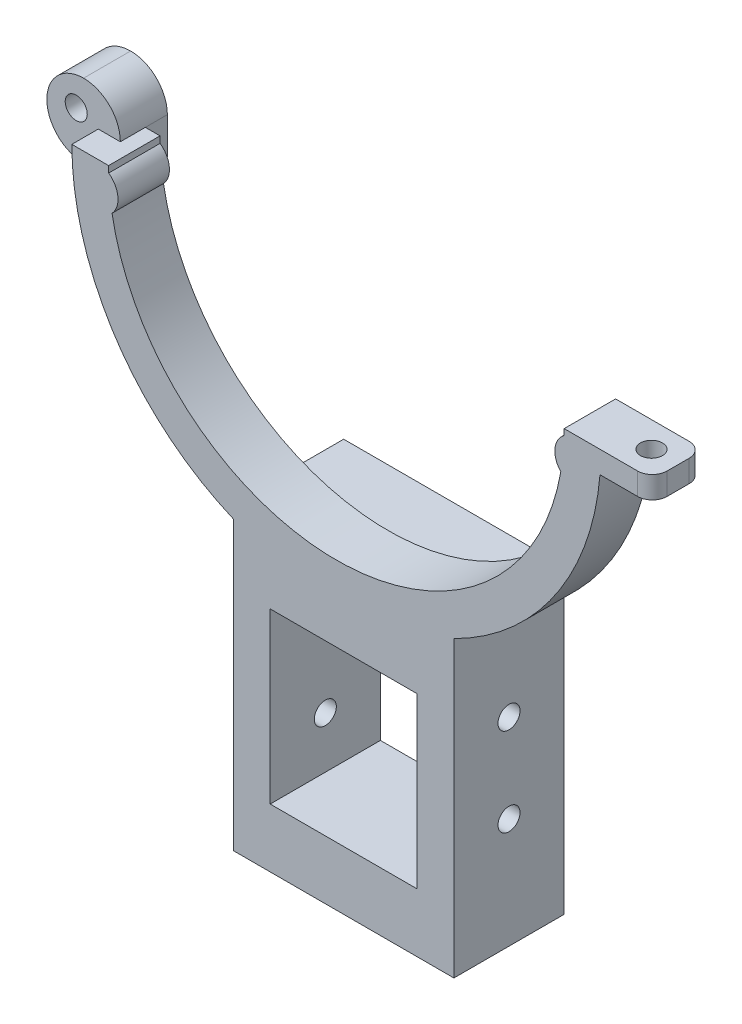
ISO-10303-21;
HEADER;
FILE_DESCRIPTION(('STEP AP214'),'2;1');
FILE_NAME('part.step','',(''),(''),'','','');
FILE_SCHEMA(('AUTOMOTIVE_DESIGN { 1 0 10303 214 1 1 1 1 }'));
ENDSEC;
DATA;
#1=APPLICATION_CONTEXT('core data for automotive mechanical design processes');
#2=APPLICATION_PROTOCOL_DEFINITION('international standard','automotive_design',2000,#1);
#3=PRODUCT_CONTEXT('',#1,'mechanical');
#4=PRODUCT('Part','Part','',(#3));
#5=PRODUCT_RELATED_PRODUCT_CATEGORY('part','',(#4));
#6=PRODUCT_DEFINITION_FORMATION('','',#4);
#7=PRODUCT_DEFINITION_CONTEXT('part definition',#1,'design');
#8=PRODUCT_DEFINITION('design','',#6,#7);
#9=PRODUCT_DEFINITION_SHAPE('','',#8);
#10=(LENGTH_UNIT() NAMED_UNIT(*) SI_UNIT(.MILLI.,.METRE.));
#11=(NAMED_UNIT(*) PLANE_ANGLE_UNIT() SI_UNIT($,.RADIAN.));
#12=(NAMED_UNIT(*) SI_UNIT($,.STERADIAN.) SOLID_ANGLE_UNIT());
#13=UNCERTAINTY_MEASURE_WITH_UNIT(LENGTH_MEASURE(1.E-05),#10,'distance_accuracy_value','');
#14=(GEOMETRIC_REPRESENTATION_CONTEXT(3) GLOBAL_UNCERTAINTY_ASSIGNED_CONTEXT((#13)) GLOBAL_UNIT_ASSIGNED_CONTEXT((#10,
#11,#12)) REPRESENTATION_CONTEXT('',''));
#15=CARTESIAN_POINT('',(0.,0.,0.));
#16=DIRECTION('',(0.,0.,1.));
#17=DIRECTION('',(1.,0.,0.));
#18=AXIS2_PLACEMENT_3D('',#15,#16,#17);
#19=CARTESIAN_POINT('',(0.,0.,0.));
#20=DIRECTION('',(0.,0.,1.));
#21=DIRECTION('',(1.,0.,0.));
#22=AXIS2_PLACEMENT_3D('',#19,#20,#21);
#23=PLANE('',#22);
#24=DIRECTION('',(0.,-1.,0.));
#25=VECTOR('',#24,1.);
#26=CARTESIAN_POINT('',(15.9930245371928,-31.2524908519132,0.));
#27=LINE('',#26,#25);
#28=CARTESIAN_POINT('',(15.9930245371928,-31.2524908519132,0.));
#29=VERTEX_POINT('',#28);
#30=CARTESIAN_POINT('',(15.9930245371928,-32.2524908519132,0.));
#31=VERTEX_POINT('',#30);
#32=EDGE_CURVE('E260',#29,#31,#27,.T.);
#33=ORIENTED_EDGE('',*,*,#32,.F.);
#34=DIRECTION('',(1.,0.,0.));
#35=VECTOR('',#34,1.);
#36=CARTESIAN_POINT('',(15.9930245371928,-31.2524908519132,0.));
#37=LINE('',#36,#35);
#38=CARTESIAN_POINT('',(-14.0069754628072,-31.2524908519132,0.));
#39=VERTEX_POINT('',#38);
#40=EDGE_CURVE('E265',#39,#29,#37,.T.);
#41=ORIENTED_EDGE('',*,*,#40,.F.);
#42=DIRECTION('',(0.,1.,0.));
#43=VECTOR('',#42,1.);
#44=CARTESIAN_POINT('',(-14.0069754628072,-31.2524908519132,0.));
#45=LINE('',#44,#43);
#46=CARTESIAN_POINT('',(-14.0069754628072,-33.1633025856038,0.));
#47=VERTEX_POINT('',#46);
#48=EDGE_CURVE('E275',#47,#39,#45,.T.);
#49=ORIENTED_EDGE('',*,*,#48,.F.);
#50=CARTESIAN_POINT('',(0.,0.,0.));
#51=DIRECTION('',(0.,0.,1.));
#52=DIRECTION('',(1.,0.,0.));
#53=AXIS2_PLACEMENT_3D('',#50,#51,#52);
#54=CIRCLE('',#53,36.);
#55=CARTESIAN_POINT('',(-35.6510869399518,-5.00000000000014,0.));
#56=VERTEX_POINT('',#55);
#57=EDGE_CURVE('E364',#56,#47,#54,.T.);
#58=ORIENTED_EDGE('',*,*,#57,.F.);
#59=DIRECTION('',(-1.,0.,0.));
#60=VECTOR('',#59,1.);
#61=CARTESIAN_POINT('',(0.,-5.00000000000014,0.));
#62=LINE('',#61,#60);
#63=CARTESIAN_POINT('',(-33.,-5.00000000000014,0.));
#64=VERTEX_POINT('',#63);
#65=EDGE_CURVE('E393',#64,#56,#62,.T.);
#66=ORIENTED_EDGE('',*,*,#65,.F.);
#67=DIRECTION('',(0.,-1.,0.));
#68=VECTOR('',#67,1.);
#69=CARTESIAN_POINT('',(-33.,0.,0.));
#70=LINE('',#69,#68);
#71=CARTESIAN_POINT('',(-33.,-1.27342887493382E-13,0.));
#72=VERTEX_POINT('',#71);
#73=EDGE_CURVE('E396',#72,#64,#70,.T.);
#74=ORIENTED_EDGE('',*,*,#73,.F.);
#75=DIRECTION('',(1.,0.,0.));
#76=VECTOR('',#75,1.);
#77=CARTESIAN_POINT('',(0.,0.,0.));
#78=LINE('',#77,#76);
#79=CARTESIAN_POINT('',(-31.,-1.19625136736208E-13,0.));
#80=VERTEX_POINT('',#79);
#81=EDGE_CURVE('E362',#72,#80,#78,.T.);
#82=ORIENTED_EDGE('',*,*,#81,.T.);
#83=CARTESIAN_POINT('',(0.,0.,0.));
#84=DIRECTION('',(0.,0.,1.));
#85=DIRECTION('',(1.,0.,0.));
#86=AXIS2_PLACEMENT_3D('',#83,#84,#85);
#87=CIRCLE('',#86,31.);
#88=CARTESIAN_POINT('',(-30.9874565828908,-0.881779180666261,0.));
#89=VERTEX_POINT('',#88);
#90=EDGE_CURVE('E355',#80,#89,#87,.T.);
#91=ORIENTED_EDGE('',*,*,#90,.T.);
#92=CARTESIAN_POINT('',(-32.7162886303256,-3.33354176129319,0.));
#93=DIRECTION('',(0.,0.,1.));
#94=DIRECTION('',(1.,0.,0.));
#95=AXIS2_PLACEMENT_3D('',#92,#93,#94);
#96=CIRCLE('',#95,3.);
#97=CARTESIAN_POINT('',(-30.5284872887118,-5.38622909492017,0.));
#98=VERTEX_POINT('',#97);
#99=EDGE_CURVE('E359',#98,#89,#96,.T.);
#100=ORIENTED_EDGE('',*,*,#99,.F.);
#101=CARTESIAN_POINT('',(30.539836630561,-5.32150153421428,0.));
#102=VERTEX_POINT('',#101);
#103=EDGE_CURVE('E356',#98,#102,#87,.T.);
#104=ORIENTED_EDGE('',*,*,#103,.T.);
#105=CARTESIAN_POINT('',(32.7312790320065,-3.2727018365506,0.));
#106=DIRECTION('',(0.,0.,1.));
#107=DIRECTION('',(1.,0.,0.));
#108=AXIS2_PLACEMENT_3D('',#105,#106,#107);
#109=CIRCLE('',#108,3.);
#110=CARTESIAN_POINT('',(30.9888714898245,-0.830568351880452,0.));
#111=VERTEX_POINT('',#110);
#112=EDGE_CURVE('E354',#111,#102,#109,.T.);
#113=ORIENTED_EDGE('',*,*,#112,.F.);
#114=CARTESIAN_POINT('',(31.,1.19625136736207E-13,0.));
#115=VERTEX_POINT('',#114);
#116=EDGE_CURVE('E327',#111,#115,#87,.T.);
#117=ORIENTED_EDGE('',*,*,#116,.T.);
#118=CARTESIAN_POINT('',(41.,1.58213890522081E-13,0.));
#119=VERTEX_POINT('',#118);
#120=EDGE_CURVE('E332',#115,#119,#78,.T.);
#121=ORIENTED_EDGE('',*,*,#120,.T.);
#122=DIRECTION('',(0.,1.,0.));
#123=VECTOR('',#122,1.);
#124=CARTESIAN_POINT('',(41.,1.18767883976804E-13,0.));
#125=LINE('',#124,#123);
#126=CARTESIAN_POINT('',(41.,-2.99999999999988,0.));
#127=VERTEX_POINT('',#126);
#128=EDGE_CURVE('E430',#119,#127,#125,.F.);
#129=ORIENTED_EDGE('',*,*,#128,.T.);
#130=DIRECTION('',(-1.,0.,0.));
#131=VECTOR('',#130,1.);
#132=CARTESIAN_POINT('',(35.,-2.99999999999988,0.));
#133=LINE('',#132,#131);
#134=CARTESIAN_POINT('',(35.8747822293042,-2.99999999999988,0.));
#135=VERTEX_POINT('',#134);
#136=EDGE_CURVE('E291',#127,#135,#133,.T.);
#137=ORIENTED_EDGE('',*,*,#136,.T.);
#138=EDGE_CURVE('E367',#31,#135,#54,.T.);
#139=ORIENTED_EDGE('',*,*,#138,.F.);
#140=EDGE_LOOP('',(#33,#41,#49,#58,#66,#74,#82,#91,#100,#104,#113,#117,#121,#129,#137,#139));
#141=FACE_BOUND('',#140,.T.);
#142=ADVANCED_FACE('F36',(#141),#23,.F.);
#143=CARTESIAN_POINT('',(41.,0.,5.));
#144=DIRECTION('',(0.,1.,0.));
#145=DIRECTION('',(0.,0.,1.));
#146=AXIS2_PLACEMENT_3D('',#143,#144,#145);
#147=CYLINDRICAL_SURFACE('',#146,2.);
#148=DIRECTION('',(0.,1.,0.));
#149=VECTOR('',#148,1.);
#150=CARTESIAN_POINT('',(41.,0.,7.));
#151=LINE('',#150,#149);
#152=CARTESIAN_POINT('',(41.,-2.99999999999988,7.));
#153=VERTEX_POINT('',#152);
#154=CARTESIAN_POINT('',(41.,1.58213890522081E-13,7.));
#155=VERTEX_POINT('',#154);
#156=EDGE_CURVE('E438',#153,#155,#151,.T.);
#157=ORIENTED_EDGE('',*,*,#156,.F.);
#158=CARTESIAN_POINT('',(41.,-2.99999999999988,5.));
#159=DIRECTION('',(0.,-1.,0.));
#160=DIRECTION('',(1.,0.,0.));
#161=AXIS2_PLACEMENT_3D('',#158,#159,#160);
#162=CIRCLE('',#161,2.);
#163=CARTESIAN_POINT('',(43.,-2.99999999999988,5.));
#164=VERTEX_POINT('',#163);
#165=EDGE_CURVE('E45',#164,#153,#162,.T.);
#166=ORIENTED_EDGE('',*,*,#165,.F.);
#167=DIRECTION('',(0.,1.,0.));
#168=VECTOR('',#167,1.);
#169=CARTESIAN_POINT('',(43.,1.18767883976804E-13,5.));
#170=LINE('',#169,#168);
#171=CARTESIAN_POINT('',(43.,1.18767883976804E-13,5.));
#172=VERTEX_POINT('',#171);
#173=EDGE_CURVE('E441',#172,#164,#170,.F.);
#174=ORIENTED_EDGE('',*,*,#173,.F.);
#175=CARTESIAN_POINT('',(41.,1.58213890522081E-13,5.));
#176=DIRECTION('',(0.,1.,0.));
#177=DIRECTION('',(-1.,0.,0.));
#178=AXIS2_PLACEMENT_3D('',#175,#176,#177);
#179=CIRCLE('',#178,2.);
#180=EDGE_CURVE('E11',#155,#172,#179,.T.);
#181=ORIENTED_EDGE('',*,*,#180,.F.);
#182=EDGE_LOOP('',(#157,#166,#174,#181));
#183=FACE_BOUND('',#182,.T.);
#184=ADVANCED_FACE('F38',(#183),#147,.T.);
#185=CARTESIAN_POINT('',(41.,1.18767883976804E-13,2.));
#186=DIRECTION('',(0.,-1.,0.));
#187=DIRECTION('',(0.,0.,-1.));
#188=AXIS2_PLACEMENT_3D('',#185,#186,#187);
#189=CYLINDRICAL_SURFACE('',#188,2.);
#190=DIRECTION('',(0.,1.,0.));
#191=VECTOR('',#190,1.);
#192=CARTESIAN_POINT('',(43.,1.18767883976804E-13,2.));
#193=LINE('',#192,#191);
#194=CARTESIAN_POINT('',(43.,-2.99999999999988,2.));
#195=VERTEX_POINT('',#194);
#196=CARTESIAN_POINT('',(43.,1.18767883976804E-13,2.));
#197=VERTEX_POINT('',#196);
#198=EDGE_CURVE('E427',#195,#197,#193,.T.);
#199=ORIENTED_EDGE('',*,*,#198,.F.);
#200=CARTESIAN_POINT('',(41.,-2.99999999999988,2.));
#201=DIRECTION('',(0.,-1.,0.));
#202=DIRECTION('',(1.,0.,0.));
#203=AXIS2_PLACEMENT_3D('',#200,#201,#202);
#204=CIRCLE('',#203,2.);
#205=EDGE_CURVE('E433',#127,#195,#204,.T.);
#206=ORIENTED_EDGE('',*,*,#205,.F.);
#207=ORIENTED_EDGE('',*,*,#128,.F.);
#208=CARTESIAN_POINT('',(41.,1.58213890522081E-13,2.));
#209=DIRECTION('',(0.,1.,0.));
#210=DIRECTION('',(-1.,0.,0.));
#211=AXIS2_PLACEMENT_3D('',#208,#209,#210);
#212=CIRCLE('',#211,2.);
#213=EDGE_CURVE('E436',#197,#119,#212,.T.);
#214=ORIENTED_EDGE('',*,*,#213,.F.);
#215=EDGE_LOOP('',(#199,#206,#207,#214));
#216=FACE_BOUND('',#215,.T.);
#217=ADVANCED_FACE('F488',(#216),#189,.T.);
#218=CARTESIAN_POINT('',(-38.,-1.38777878078145E-13,-3.));
#219=DIRECTION('',(0.,0.,-1.));
#220=DIRECTION('',(-1.,0.,0.));
#221=AXIS2_PLACEMENT_3D('',#218,#219,#220);
#222=CYLINDRICAL_SURFACE('',#221,5.);
#223=DIRECTION('',(0.,0.,1.));
#224=VECTOR('',#223,1.);
#225=CARTESIAN_POINT('',(-38.,4.99999999999986,-3.));
#226=LINE('',#225,#224);
#227=CARTESIAN_POINT('',(-38.,4.99999999999986,-3.));
#228=VERTEX_POINT('',#227);
#229=CARTESIAN_POINT('',(-38.,4.99999999999986,3.4));
#230=VERTEX_POINT('',#229);
#231=EDGE_CURVE('E413',#228,#230,#226,.T.);
#232=ORIENTED_EDGE('',*,*,#231,.T.);
#233=CARTESIAN_POINT('',(-38.,-1.38777878078145E-13,3.4));
#234=DIRECTION('',(0.,0.,-1.));
#235=DIRECTION('',(-1.,0.,0.));
#236=AXIS2_PLACEMENT_3D('',#233,#234,#235);
#237=CIRCLE('',#236,5.);
#238=CARTESIAN_POINT('',(-33.,-1.27342887493382E-13,3.4));
#239=VERTEX_POINT('',#238);
#240=EDGE_CURVE('E423',#239,#230,#237,.F.);
#241=ORIENTED_EDGE('',*,*,#240,.F.);
#242=DIRECTION('',(0.,0.,1.));
#243=VECTOR('',#242,1.);
#244=CARTESIAN_POINT('',(-33.,-1.27342887493382E-13,7.));
#245=LINE('',#244,#243);
#246=EDGE_CURVE('E322',#72,#239,#245,.T.);
#247=ORIENTED_EDGE('',*,*,#246,.F.);
#248=DIRECTION('',(0.,0.,-1.));
#249=VECTOR('',#248,1.);
#250=CARTESIAN_POINT('',(-33.,-1.38777878078145E-13,-3.));
#251=LINE('',#250,#249);
#252=CARTESIAN_POINT('',(-33.,-1.38777878078145E-13,-3.));
#253=VERTEX_POINT('',#252);
#254=EDGE_CURVE('E421',#253,#72,#251,.F.);
#255=ORIENTED_EDGE('',*,*,#254,.F.);
#256=CARTESIAN_POINT('',(-38.,-1.38777878078145E-13,-3.));
#257=DIRECTION('',(0.,0.,-1.));
#258=DIRECTION('',(-1.,0.,0.));
#259=AXIS2_PLACEMENT_3D('',#256,#257,#258);
#260=CIRCLE('',#259,5.);
#261=EDGE_CURVE('E425',#228,#253,#260,.T.);
#262=ORIENTED_EDGE('',*,*,#261,.F.);
#263=EDGE_LOOP('',(#232,#241,#247,#255,#262));
#264=FACE_BOUND('',#263,.T.);
#265=ADVANCED_FACE('F536',(#264),#222,.T.);
#266=CARTESIAN_POINT('',(-38.,-1.38777878078145E-13,-3.));
#267=DIRECTION('',(0.,0.,1.));
#268=DIRECTION('',(1.,0.,0.));
#269=AXIS2_PLACEMENT_3D('',#266,#267,#268);
#270=CYLINDRICAL_SURFACE('',#269,5.);
#271=ORIENTED_EDGE('',*,*,#231,.F.);
#272=CARTESIAN_POINT('',(-38.,-1.38777878078145E-13,-3.));
#273=DIRECTION('',(0.,0.,-1.));
#274=DIRECTION('',(-1.,0.,0.));
#275=AXIS2_PLACEMENT_3D('',#272,#273,#274);
#276=CIRCLE('',#275,5.);
#277=CARTESIAN_POINT('',(-43.,-1.39645239816133E-13,-3.));
#278=VERTEX_POINT('',#277);
#279=EDGE_CURVE('E416',#278,#228,#276,.T.);
#280=ORIENTED_EDGE('',*,*,#279,.F.);
#281=DIRECTION('',(0.,0.,1.));
#282=VECTOR('',#281,1.);
#283=CARTESIAN_POINT('',(-43.,-1.38777878078145E-13,-3.));
#284=LINE('',#283,#282);
#285=CARTESIAN_POINT('',(-43.,-1.39645239816133E-13,3.4));
#286=VERTEX_POINT('',#285);
#287=EDGE_CURVE('E402',#278,#286,#284,.T.);
#288=ORIENTED_EDGE('',*,*,#287,.T.);
#289=CARTESIAN_POINT('',(-38.,-1.38777878078145E-13,3.4));
#290=DIRECTION('',(0.,0.,-1.));
#291=DIRECTION('',(-1.,0.,0.));
#292=AXIS2_PLACEMENT_3D('',#289,#290,#291);
#293=CIRCLE('',#292,5.);
#294=EDGE_CURVE('E419',#230,#286,#293,.F.);
#295=ORIENTED_EDGE('',*,*,#294,.F.);
#296=EDGE_LOOP('',(#271,#280,#288,#295));
#297=FACE_BOUND('',#296,.T.);
#298=ADVANCED_FACE('F532',(#297),#270,.T.);
#299=CARTESIAN_POINT('',(-38.,-1.38777878078145E-13,-3.));
#300=DIRECTION('',(0.,0.,1.));
#301=DIRECTION('',(1.,0.,0.));
#302=AXIS2_PLACEMENT_3D('',#299,#300,#301);
#303=CYLINDRICAL_SURFACE('',#302,5.);
#304=ORIENTED_EDGE('',*,*,#287,.F.);
#305=CARTESIAN_POINT('',(-38.,-1.38777878078145E-13,-3.));
#306=DIRECTION('',(0.,0.,-1.));
#307=DIRECTION('',(-1.,0.,0.));
#308=AXIS2_PLACEMENT_3D('',#305,#306,#307);
#309=CIRCLE('',#308,5.);
#310=CARTESIAN_POINT('',(-38.,-5.00000000000014,-3.));
#311=VERTEX_POINT('',#310);
#312=EDGE_CURVE('E408',#311,#278,#309,.T.);
#313=ORIENTED_EDGE('',*,*,#312,.F.);
#314=DIRECTION('',(0.,0.,1.));
#315=VECTOR('',#314,1.);
#316=CARTESIAN_POINT('',(-38.,-5.00000000000014,-3.));
#317=LINE('',#316,#315);
#318=CARTESIAN_POINT('',(-38.,-5.00000000000014,3.4));
#319=VERTEX_POINT('',#318);
#320=EDGE_CURVE('E405',#319,#311,#317,.F.);
#321=ORIENTED_EDGE('',*,*,#320,.F.);
#322=CARTESIAN_POINT('',(-38.,-1.38777878078145E-13,3.4));
#323=DIRECTION('',(0.,0.,-1.));
#324=DIRECTION('',(-1.,0.,0.));
#325=AXIS2_PLACEMENT_3D('',#322,#323,#324);
#326=CIRCLE('',#325,5.);
#327=EDGE_CURVE('E411',#286,#319,#326,.F.);
#328=ORIENTED_EDGE('',*,*,#327,.F.);
#329=EDGE_LOOP('',(#304,#313,#321,#328));
#330=FACE_BOUND('',#329,.T.);
#331=ADVANCED_FACE('F529',(#330),#303,.T.);
#332=CARTESIAN_POINT('',(0.,0.,7.));
#333=DIRECTION('',(0.,1.,0.));
#334=DIRECTION('',(-1.,0.,0.));
#335=AXIS2_PLACEMENT_3D('',#332,#333,#334);
#336=PLANE('',#335);
#337=ORIENTED_EDGE('',*,*,#81,.F.);
#338=ORIENTED_EDGE('',*,*,#246,.T.);
#339=DIRECTION('',(-1.,0.,0.));
#340=VECTOR('',#339,1.);
#341=CARTESIAN_POINT('',(0.,0.,3.4));
#342=LINE('',#341,#340);
#343=CARTESIAN_POINT('',(-36.,-1.38919513629144E-13,3.4));
#344=VERTEX_POINT('',#343);
#345=EDGE_CURVE('E325',#239,#344,#342,.T.);
#346=ORIENTED_EDGE('',*,*,#345,.T.);
#347=DIRECTION('',(0.,0.,-1.));
#348=VECTOR('',#347,1.);
#349=CARTESIAN_POINT('',(-36.,-1.38919513629144E-13,7.));
#350=LINE('',#349,#348);
#351=CARTESIAN_POINT('',(-36.,-1.38919513629144E-13,7.));
#352=VERTEX_POINT('',#351);
#353=EDGE_CURVE('E379',#352,#344,#350,.T.);
#354=ORIENTED_EDGE('',*,*,#353,.F.);
#355=DIRECTION('',(1.,0.,0.));
#356=VECTOR('',#355,1.);
#357=CARTESIAN_POINT('',(0.,0.,7.));
#358=LINE('',#357,#356);
#359=CARTESIAN_POINT('',(-31.,-1.19625136736208E-13,7.));
#360=VERTEX_POINT('',#359);
#361=EDGE_CURVE('E338',#352,#360,#358,.T.);
#362=ORIENTED_EDGE('',*,*,#361,.T.);
#363=DIRECTION('',(0.,0.,-1.));
#364=VECTOR('',#363,1.);
#365=CARTESIAN_POINT('',(-31.,-1.19625136736208E-13,7.));
#366=LINE('',#365,#364);
#367=EDGE_CURVE('E382',#360,#80,#366,.T.);
#368=ORIENTED_EDGE('',*,*,#367,.T.);
#369=EDGE_LOOP('',(#337,#338,#346,#354,#362,#368));
#370=FACE_BOUND('',#369,.T.);
#371=ADVANCED_FACE('F499',(#370),#336,.T.);
#372=CARTESIAN_POINT('',(0.,0.,7.));
#373=DIRECTION('',(0.,0.,-1.));
#374=DIRECTION('',(-1.,0.,0.));
#375=AXIS2_PLACEMENT_3D('',#372,#373,#374);
#376=CYLINDRICAL_SURFACE('',#375,36.);
#377=DIRECTION('',(0.,0.,-1.));
#378=VECTOR('',#377,1.);
#379=CARTESIAN_POINT('',(-35.6510869399518,-5.00000000000014,7.));
#380=LINE('',#379,#378);
#381=CARTESIAN_POINT('',(-35.6510869399518,-5.00000000000014,3.4));
#382=VERTEX_POINT('',#381);
#383=EDGE_CURVE('E319',#56,#382,#380,.F.);
#384=ORIENTED_EDGE('',*,*,#383,.F.);
#385=ORIENTED_EDGE('',*,*,#57,.T.);
#386=DIRECTION('',(0.,0.,-1.));
#387=VECTOR('',#386,1.);
#388=CARTESIAN_POINT('',(-14.0069754628072,-33.1633025856038,7.));
#389=LINE('',#388,#387);
#390=CARTESIAN_POINT('',(-14.0069754628072,-33.1633025856038,7.));
#391=VERTEX_POINT('',#390);
#392=EDGE_CURVE('E376',#391,#47,#389,.T.);
#393=ORIENTED_EDGE('',*,*,#392,.F.);
#394=CARTESIAN_POINT('',(0.,0.,7.));
#395=DIRECTION('',(0.,0.,1.));
#396=DIRECTION('',(1.,0.,0.));
#397=AXIS2_PLACEMENT_3D('',#394,#395,#396);
#398=CIRCLE('',#397,36.);
#399=EDGE_CURVE('E341',#352,#391,#398,.T.);
#400=ORIENTED_EDGE('',*,*,#399,.F.);
#401=ORIENTED_EDGE('',*,*,#353,.T.);
#402=CARTESIAN_POINT('',(0.,0.,3.4));
#403=DIRECTION('',(0.,0.,-1.));
#404=DIRECTION('',(-1.,0.,0.));
#405=AXIS2_PLACEMENT_3D('',#402,#403,#404);
#406=CIRCLE('',#405,36.);
#407=EDGE_CURVE('E399',#382,#344,#406,.T.);
#408=ORIENTED_EDGE('',*,*,#407,.F.);
#409=EDGE_LOOP('',(#384,#385,#393,#400,#401,#408));
#410=FACE_BOUND('',#409,.T.);
#411=ADVANCED_FACE('F504',(#410),#376,.T.);
#412=CARTESIAN_POINT('',(0.,0.,7.));
#413=DIRECTION('',(0.,0.,-1.));
#414=DIRECTION('',(-1.,0.,0.));
#415=AXIS2_PLACEMENT_3D('',#412,#413,#414);
#416=CYLINDRICAL_SURFACE('',#415,31.);
#417=ORIENTED_EDGE('',*,*,#116,.F.);
#418=DIRECTION('',(0.,0.,-1.));
#419=VECTOR('',#418,1.);
#420=CARTESIAN_POINT('',(30.9888714898245,-0.830568351880452,7.));
#421=LINE('',#420,#419);
#422=CARTESIAN_POINT('',(30.9888714898245,-0.830568351880452,7.));
#423=VERTEX_POINT('',#422);
#424=EDGE_CURVE('E391',#423,#111,#421,.T.);
#425=ORIENTED_EDGE('',*,*,#424,.F.);
#426=CARTESIAN_POINT('',(0.,0.,7.));
#427=DIRECTION('',(0.,0.,1.));
#428=DIRECTION('',(1.,0.,0.));
#429=AXIS2_PLACEMENT_3D('',#426,#427,#428);
#430=CIRCLE('',#429,31.);
#431=CARTESIAN_POINT('',(31.,1.19625136736207E-13,7.));
#432=VERTEX_POINT('',#431);
#433=EDGE_CURVE('E328',#423,#432,#430,.T.);
#434=ORIENTED_EDGE('',*,*,#433,.T.);
#435=DIRECTION('',(0.,0.,-1.));
#436=VECTOR('',#435,1.);
#437=CARTESIAN_POINT('',(31.,1.19625136736207E-13,7.));
#438=LINE('',#437,#436);
#439=EDGE_CURVE('E368',#432,#115,#438,.T.);
#440=ORIENTED_EDGE('',*,*,#439,.T.);
#441=EDGE_LOOP('',(#417,#425,#434,#440));
#442=FACE_BOUND('',#441,.T.);
#443=ADVANCED_FACE('F520',(#442),#416,.F.);
#444=CARTESIAN_POINT('',(32.7312790320065,-3.2727018365506,7.));
#445=DIRECTION('',(0.,0.,-1.));
#446=DIRECTION('',(-1.,0.,0.));
#447=AXIS2_PLACEMENT_3D('',#444,#445,#446);
#448=CYLINDRICAL_SURFACE('',#447,3.);
#449=ORIENTED_EDGE('',*,*,#112,.T.);
#450=DIRECTION('',(0.,0.,-1.));
#451=VECTOR('',#450,1.);
#452=CARTESIAN_POINT('',(30.539836630561,-5.32150153421428,7.));
#453=LINE('',#452,#451);
#454=CARTESIAN_POINT('',(30.539836630561,-5.32150153421428,7.));
#455=VERTEX_POINT('',#454);
#456=EDGE_CURVE('E389',#455,#102,#453,.T.);
#457=ORIENTED_EDGE('',*,*,#456,.F.);
#458=CARTESIAN_POINT('',(32.7312790320065,-3.2727018365506,7.));
#459=DIRECTION('',(0.,0.,1.));
#460=DIRECTION('',(1.,0.,0.));
#461=AXIS2_PLACEMENT_3D('',#458,#459,#460);
#462=CIRCLE('',#461,3.);
#463=EDGE_CURVE('E331',#423,#455,#462,.T.);
#464=ORIENTED_EDGE('',*,*,#463,.F.);
#465=ORIENTED_EDGE('',*,*,#424,.T.);
#466=EDGE_LOOP('',(#449,#457,#464,#465));
#467=FACE_BOUND('',#466,.T.);
#468=ADVANCED_FACE('F525',(#467),#448,.T.);
#469=ORIENTED_EDGE('',*,*,#103,.F.);
#470=DIRECTION('',(0.,0.,-1.));
#471=VECTOR('',#470,1.);
#472=CARTESIAN_POINT('',(-30.5284872887118,-5.38622909492017,7.));
#473=LINE('',#472,#471);
#474=CARTESIAN_POINT('',(-30.5284872887118,-5.38622909492017,7.));
#475=VERTEX_POINT('',#474);
#476=EDGE_CURVE('E387',#475,#98,#473,.T.);
#477=ORIENTED_EDGE('',*,*,#476,.F.);
#478=EDGE_CURVE('E334',#475,#455,#430,.T.);
#479=ORIENTED_EDGE('',*,*,#478,.T.);
#480=ORIENTED_EDGE('',*,*,#456,.T.);
#481=EDGE_LOOP('',(#469,#477,#479,#480));
#482=FACE_BOUND('',#481,.T.);
#483=ADVANCED_FACE('F521',(#482),#416,.F.);
#484=CARTESIAN_POINT('',(-32.7162886303256,-3.33354176129319,7.));
#485=DIRECTION('',(0.,0.,-1.));
#486=DIRECTION('',(-1.,0.,0.));
#487=AXIS2_PLACEMENT_3D('',#484,#485,#486);
#488=CYLINDRICAL_SURFACE('',#487,3.);
#489=ORIENTED_EDGE('',*,*,#99,.T.);
#490=DIRECTION('',(0.,0.,-1.));
#491=VECTOR('',#490,1.);
#492=CARTESIAN_POINT('',(-30.9874565828908,-0.881779180666261,7.));
#493=LINE('',#492,#491);
#494=CARTESIAN_POINT('',(-30.9874565828908,-0.881779180666261,7.));
#495=VERTEX_POINT('',#494);
#496=EDGE_CURVE('E385',#495,#89,#493,.T.);
#497=ORIENTED_EDGE('',*,*,#496,.F.);
#498=CARTESIAN_POINT('',(-32.7162886303256,-3.33354176129319,7.));
#499=DIRECTION('',(0.,0.,1.));
#500=DIRECTION('',(1.,0.,0.));
#501=AXIS2_PLACEMENT_3D('',#498,#499,#500);
#502=CIRCLE('',#501,3.);
#503=EDGE_CURVE('E336',#475,#495,#502,.T.);
#504=ORIENTED_EDGE('',*,*,#503,.F.);
#505=ORIENTED_EDGE('',*,*,#476,.T.);
#506=EDGE_LOOP('',(#489,#497,#504,#505));
#507=FACE_BOUND('',#506,.T.);
#508=ADVANCED_FACE('F518',(#507),#488,.T.);
#509=ORIENTED_EDGE('',*,*,#90,.F.);
#510=ORIENTED_EDGE('',*,*,#367,.F.);
#511=EDGE_CURVE('E333',#360,#495,#430,.T.);
#512=ORIENTED_EDGE('',*,*,#511,.T.);
#513=ORIENTED_EDGE('',*,*,#496,.T.);
#514=EDGE_LOOP('',(#509,#510,#512,#513));
#515=FACE_BOUND('',#514,.T.);
#516=ADVANCED_FACE('F514',(#515),#416,.F.);
#517=CARTESIAN_POINT('',(-14.0069754628072,0.,7.));
#518=DIRECTION('',(1.,0.,0.));
#519=DIRECTION('',(0.,1.,0.));
#520=AXIS2_PLACEMENT_3D('',#517,#518,#519);
#521=PLANE('',#520);
#522=CARTESIAN_POINT('',(-14.0069754628072,-57.2524908519132,-0.5));
#523=DIRECTION('',(1.,0.,0.));
#524=DIRECTION('',(0.,1.,0.));
#525=AXIS2_PLACEMENT_3D('',#522,#523,#524);
#526=CIRCLE('',#525,1.5);
#527=CARTESIAN_POINT('',(-14.0069754628072,-55.7524908519132,-0.5));
#528=VERTEX_POINT('',#527);
#529=EDGE_CURVE('E454',#528,#528,#526,.T.);
#530=ORIENTED_EDGE('',*,*,#529,.T.);
#531=EDGE_LOOP('',(#530));
#532=FACE_BOUND('',#531,.T.);
#533=CARTESIAN_POINT('',(-14.0069754628072,-45.2524908519133,-0.5));
#534=DIRECTION('',(1.,0.,0.));
#535=DIRECTION('',(0.,1.,0.));
#536=AXIS2_PLACEMENT_3D('',#533,#534,#535);
#537=CIRCLE('',#536,1.5);
#538=CARTESIAN_POINT('',(-14.0069754628072,-43.7524908519132,-0.5));
#539=VERTEX_POINT('',#538);
#540=EDGE_CURVE('E451',#539,#539,#537,.T.);
#541=ORIENTED_EDGE('',*,*,#540,.T.);
#542=EDGE_LOOP('',(#541));
#543=FACE_BOUND('',#542,.T.);
#544=ORIENTED_EDGE('',*,*,#392,.T.);
#545=ORIENTED_EDGE('',*,*,#48,.T.);
#546=DIRECTION('',(0.,0.,1.));
#547=VECTOR('',#546,1.);
#548=CARTESIAN_POINT('',(-14.0069754628072,-31.2524908519132,-8.));
#549=LINE('',#548,#547);
#550=CARTESIAN_POINT('',(-14.0069754628072,-31.2524908519132,-8.));
#551=VERTEX_POINT('',#550);
#552=EDGE_CURVE('E282',#551,#39,#549,.T.);
#553=ORIENTED_EDGE('',*,*,#552,.F.);
#554=DIRECTION('',(0.,1.,0.));
#555=VECTOR('',#554,1.);
#556=CARTESIAN_POINT('',(-14.0069754628072,-31.2524908519132,-8.));
#557=LINE('',#556,#555);
#558=CARTESIAN_POINT('',(-14.0069754628072,-72.2524908519132,-8.));
#559=VERTEX_POINT('',#558);
#560=EDGE_CURVE('E268',#559,#551,#557,.T.);
#561=ORIENTED_EDGE('',*,*,#560,.F.);
#562=DIRECTION('',(0.,0.,-1.));
#563=VECTOR('',#562,1.);
#564=CARTESIAN_POINT('',(-14.0069754628072,-72.2524908519132,7.));
#565=LINE('',#564,#563);
#566=CARTESIAN_POINT('',(-14.0069754628072,-72.2524908519132,7.));
#567=VERTEX_POINT('',#566);
#568=EDGE_CURVE('E374',#567,#559,#565,.T.);
#569=ORIENTED_EDGE('',*,*,#568,.F.);
#570=DIRECTION('',(0.,-1.,0.));
#571=VECTOR('',#570,1.);
#572=CARTESIAN_POINT('',(-14.0069754628072,0.,7.));
#573=LINE('',#572,#571);
#574=EDGE_CURVE('E344',#391,#567,#573,.T.);
#575=ORIENTED_EDGE('',*,*,#574,.F.);
#576=EDGE_LOOP('',(#544,#545,#553,#561,#569,#575));
#577=FACE_BOUND('',#576,.T.);
#578=ADVANCED_FACE('F466',(#532,#543,#577),#521,.F.);
#579=CARTESIAN_POINT('',(0.,-72.2524908519132,7.));
#580=DIRECTION('',(0.,1.,0.));
#581=DIRECTION('',(-1.,0.,0.));
#582=AXIS2_PLACEMENT_3D('',#579,#580,#581);
#583=PLANE('',#582);
#584=ORIENTED_EDGE('',*,*,#568,.T.);
#585=DIRECTION('',(-1.,0.,0.));
#586=VECTOR('',#585,1.);
#587=CARTESIAN_POINT('',(15.9930245371928,-72.2524908519132,-8.));
#588=LINE('',#587,#586);
#589=CARTESIAN_POINT('',(15.9930245371928,-72.2524908519132,-8.));
#590=VERTEX_POINT('',#589);
#591=EDGE_CURVE('E264',#590,#559,#588,.T.);
#592=ORIENTED_EDGE('',*,*,#591,.F.);
#593=DIRECTION('',(0.,0.,-1.));
#594=VECTOR('',#593,1.);
#595=CARTESIAN_POINT('',(15.9930245371928,-72.2524908519132,7.));
#596=LINE('',#595,#594);
#597=CARTESIAN_POINT('',(15.9930245371928,-72.2524908519132,7.));
#598=VERTEX_POINT('',#597);
#599=EDGE_CURVE('E372',#598,#590,#596,.T.);
#600=ORIENTED_EDGE('',*,*,#599,.F.);
#601=DIRECTION('',(1.,0.,0.));
#602=VECTOR('',#601,1.);
#603=CARTESIAN_POINT('',(0.,-72.2524908519132,7.));
#604=LINE('',#603,#602);
#605=EDGE_CURVE('E347',#567,#598,#604,.T.);
#606=ORIENTED_EDGE('',*,*,#605,.F.);
#607=EDGE_LOOP('',(#584,#592,#600,#606));
#608=FACE_BOUND('',#607,.T.);
#609=ADVANCED_FACE('F507',(#608),#583,.F.);
#610=CARTESIAN_POINT('',(15.9930245371928,0.,7.));
#611=DIRECTION('',(1.,0.,0.));
#612=DIRECTION('',(0.,1.,0.));
#613=AXIS2_PLACEMENT_3D('',#610,#611,#612);
#614=PLANE('',#613);
#615=CARTESIAN_POINT('',(15.9930245371928,-57.2524908519132,-0.5));
#616=DIRECTION('',(1.,0.,0.));
#617=DIRECTION('',(0.,1.,0.));
#618=AXIS2_PLACEMENT_3D('',#615,#616,#617);
#619=CIRCLE('',#618,1.5);
#620=CARTESIAN_POINT('',(15.9930245371928,-55.7524908519132,-0.5));
#621=VERTEX_POINT('',#620);
#622=EDGE_CURVE('E741',#621,#621,#619,.T.);
#623=ORIENTED_EDGE('',*,*,#622,.F.);
#624=EDGE_LOOP('',(#623));
#625=FACE_BOUND('',#624,.T.);
#626=CARTESIAN_POINT('',(15.9930245371928,-45.2524908519132,-0.5));
#627=DIRECTION('',(1.,0.,0.));
#628=DIRECTION('',(0.,1.,0.));
#629=AXIS2_PLACEMENT_3D('',#626,#627,#628);
#630=CIRCLE('',#629,1.5);
#631=CARTESIAN_POINT('',(15.9930245371928,-43.7524908519132,-0.5));
#632=VERTEX_POINT('',#631);
#633=EDGE_CURVE('E447',#632,#632,#630,.T.);
#634=ORIENTED_EDGE('',*,*,#633,.F.);
#635=EDGE_LOOP('',(#634));
#636=FACE_BOUND('',#635,.T.);
#637=ORIENTED_EDGE('',*,*,#599,.T.);
#638=DIRECTION('',(0.,-1.,0.));
#639=VECTOR('',#638,1.);
#640=CARTESIAN_POINT('',(15.9930245371928,-31.2524908519132,-8.));
#641=LINE('',#640,#639);
#642=CARTESIAN_POINT('',(15.9930245371928,-31.2524908519132,-8.));
#643=VERTEX_POINT('',#642);
#644=EDGE_CURVE('E261',#643,#590,#641,.T.);
#645=ORIENTED_EDGE('',*,*,#644,.F.);
#646=DIRECTION('',(0.,0.,1.));
#647=VECTOR('',#646,1.);
#648=CARTESIAN_POINT('',(15.9930245371928,-31.2524908519132,-8.));
#649=LINE('',#648,#647);
#650=EDGE_CURVE('E272',#643,#29,#649,.T.);
#651=ORIENTED_EDGE('',*,*,#650,.T.);
#652=ORIENTED_EDGE('',*,*,#32,.T.);
#653=DIRECTION('',(0.,0.,-1.));
#654=VECTOR('',#653,1.);
#655=CARTESIAN_POINT('',(15.9930245371928,-32.2524908519132,7.));
#656=LINE('',#655,#654);
#657=CARTESIAN_POINT('',(15.9930245371928,-32.2524908519132,7.));
#658=VERTEX_POINT('',#657);
#659=EDGE_CURVE('E370',#658,#31,#656,.T.);
#660=ORIENTED_EDGE('',*,*,#659,.F.);
#661=DIRECTION('',(0.,-1.,0.));
#662=VECTOR('',#661,1.);
#663=CARTESIAN_POINT('',(15.9930245371928,0.,7.));
#664=LINE('',#663,#662);
#665=EDGE_CURVE('E349',#658,#598,#664,.T.);
#666=ORIENTED_EDGE('',*,*,#665,.T.);
#667=EDGE_LOOP('',(#637,#645,#651,#652,#660,#666));
#668=FACE_BOUND('',#667,.T.);
#669=ADVANCED_FACE('F502',(#625,#636,#668),#614,.T.);
#670=ORIENTED_EDGE('',*,*,#138,.T.);
#671=DIRECTION('',(0.,0.,-1.));
#672=VECTOR('',#671,1.);
#673=CARTESIAN_POINT('',(35.8747822293042,-2.99999999999988,7.));
#674=LINE('',#673,#672);
#675=CARTESIAN_POINT('',(35.8747822293042,-2.99999999999988,7.));
#676=VERTEX_POINT('',#675);
#677=EDGE_CURVE('E298',#135,#676,#674,.F.);
#678=ORIENTED_EDGE('',*,*,#677,.T.);
#679=EDGE_CURVE('E345',#658,#676,#398,.T.);
#680=ORIENTED_EDGE('',*,*,#679,.F.);
#681=ORIENTED_EDGE('',*,*,#659,.T.);
#682=EDGE_LOOP('',(#670,#678,#680,#681));
#683=FACE_BOUND('',#682,.T.);
#684=ADVANCED_FACE('F497',(#683),#376,.T.);
#685=CARTESIAN_POINT('',(39.3747822293042,1.51788304147971E-13,3.5));
#686=DIRECTION('',(0.,1.,0.));
#687=DIRECTION('',(-1.,0.,0.));
#688=AXIS2_PLACEMENT_3D('',#685,#686,#687);
#689=CIRCLE('',#688,1.5);
#690=CARTESIAN_POINT('',(37.8747822293042,1.4599999108009E-13,3.5));
#691=VERTEX_POINT('',#690);
#692=EDGE_CURVE('E288',#691,#691,#689,.T.);
#693=ORIENTED_EDGE('',*,*,#692,.F.);
#694=EDGE_LOOP('',(#693));
#695=FACE_BOUND('',#694,.T.);
#696=EDGE_CURVE('E342',#432,#155,#358,.T.);
#697=ORIENTED_EDGE('',*,*,#696,.T.);
#698=ORIENTED_EDGE('',*,*,#180,.T.);
#699=DIRECTION('',(0.,0.,-1.));
#700=VECTOR('',#699,1.);
#701=CARTESIAN_POINT('',(43.,1.18767883976804E-13,7.));
#702=LINE('',#701,#700);
#703=EDGE_CURVE('E294',#172,#197,#702,.T.);
#704=ORIENTED_EDGE('',*,*,#703,.T.);
#705=ORIENTED_EDGE('',*,*,#213,.T.);
#706=ORIENTED_EDGE('',*,*,#120,.F.);
#707=ORIENTED_EDGE('',*,*,#439,.F.);
#708=EDGE_LOOP('',(#697,#698,#704,#705,#706,#707));
#709=FACE_BOUND('',#708,.T.);
#710=ADVANCED_FACE('F494',(#695,#709),#336,.T.);
#711=CARTESIAN_POINT('',(0.,0.,7.));
#712=DIRECTION('',(0.,0.,1.));
#713=DIRECTION('',(1.,0.,0.));
#714=AXIS2_PLACEMENT_3D('',#711,#712,#713);
#715=PLANE('',#714);
#716=DIRECTION('',(0.,1.,0.));
#717=VECTOR('',#716,1.);
#718=CARTESIAN_POINT('',(10.9930245371928,0.,7.));
#719=LINE('',#718,#717);
#720=CARTESIAN_POINT('',(10.9930245371928,-64.2524908519132,7.));
#721=VERTEX_POINT('',#720);
#722=CARTESIAN_POINT('',(10.9930245371928,-41.2524908519132,7.));
#723=VERTEX_POINT('',#722);
#724=EDGE_CURVE('E258',#721,#723,#719,.T.);
#725=ORIENTED_EDGE('',*,*,#724,.F.);
#726=DIRECTION('',(1.,0.,0.));
#727=VECTOR('',#726,1.);
#728=CARTESIAN_POINT('',(0.,-64.2524908519132,7.));
#729=LINE('',#728,#727);
#730=CARTESIAN_POINT('',(-9.00697546280717,-64.2524908519132,7.));
#731=VERTEX_POINT('',#730);
#732=EDGE_CURVE('E251',#731,#721,#729,.T.);
#733=ORIENTED_EDGE('',*,*,#732,.F.);
#734=DIRECTION('',(0.,-1.,0.));
#735=VECTOR('',#734,1.);
#736=CARTESIAN_POINT('',(-9.00697546280715,0.,7.));
#737=LINE('',#736,#735);
#738=CARTESIAN_POINT('',(-9.00697546280716,-41.2524908519132,7.));
#739=VERTEX_POINT('',#738);
#740=EDGE_CURVE('E231',#739,#731,#737,.T.);
#741=ORIENTED_EDGE('',*,*,#740,.F.);
#742=DIRECTION('',(-1.,0.,0.));
#743=VECTOR('',#742,1.);
#744=CARTESIAN_POINT('',(0.,-41.2524908519132,7.));
#745=LINE('',#744,#743);
#746=EDGE_CURVE('E256',#723,#739,#745,.T.);
#747=ORIENTED_EDGE('',*,*,#746,.F.);
#748=EDGE_LOOP('',(#725,#733,#741,#747));
#749=FACE_BOUND('',#748,.T.);
#750=DIRECTION('',(-1.,0.,0.));
#751=VECTOR('',#750,1.);
#752=CARTESIAN_POINT('',(35.,-2.99999999999988,7.));
#753=LINE('',#752,#751);
#754=EDGE_CURVE('E292',#153,#676,#753,.T.);
#755=ORIENTED_EDGE('',*,*,#754,.F.);
#756=ORIENTED_EDGE('',*,*,#156,.T.);
#757=ORIENTED_EDGE('',*,*,#696,.F.);
#758=ORIENTED_EDGE('',*,*,#433,.F.);
#759=ORIENTED_EDGE('',*,*,#463,.T.);
#760=ORIENTED_EDGE('',*,*,#478,.F.);
#761=ORIENTED_EDGE('',*,*,#503,.T.);
#762=ORIENTED_EDGE('',*,*,#511,.F.);
#763=ORIENTED_EDGE('',*,*,#361,.F.);
#764=ORIENTED_EDGE('',*,*,#399,.T.);
#765=ORIENTED_EDGE('',*,*,#574,.T.);
#766=ORIENTED_EDGE('',*,*,#605,.T.);
#767=ORIENTED_EDGE('',*,*,#665,.F.);
#768=ORIENTED_EDGE('',*,*,#679,.T.);
#769=EDGE_LOOP('',(#755,#756,#757,#758,#759,#760,#761,#762,#763,#764,#765,#766,#767,#768));
#770=FACE_BOUND('',#769,.T.);
#771=ADVANCED_FACE('F492',(#749,#770),#715,.T.);
#772=CARTESIAN_POINT('',(-33.,-5.00000000000014,-3.));
#773=DIRECTION('',(0.,1.,0.));
#774=DIRECTION('',(0.,0.,1.));
#775=AXIS2_PLACEMENT_3D('',#772,#773,#774);
#776=PLANE('',#775);
#777=DIRECTION('',(-1.,0.,0.));
#778=VECTOR('',#777,1.);
#779=CARTESIAN_POINT('',(-33.,-5.00000000000014,3.4));
#780=LINE('',#779,#778);
#781=EDGE_CURVE('E308',#382,#319,#780,.T.);
#782=ORIENTED_EDGE('',*,*,#781,.T.);
#783=ORIENTED_EDGE('',*,*,#320,.T.);
#784=DIRECTION('',(-1.,0.,0.));
#785=VECTOR('',#784,1.);
#786=CARTESIAN_POINT('',(-33.,-5.00000000000014,-3.));
#787=LINE('',#786,#785);
#788=CARTESIAN_POINT('',(-33.,-5.00000000000014,-3.));
#789=VERTEX_POINT('',#788);
#790=EDGE_CURVE('E313',#789,#311,#787,.T.);
#791=ORIENTED_EDGE('',*,*,#790,.F.);
#792=DIRECTION('',(0.,0.,1.));
#793=VECTOR('',#792,1.);
#794=CARTESIAN_POINT('',(-33.,-5.00000000000014,-3.));
#795=LINE('',#794,#793);
#796=EDGE_CURVE('E316',#789,#64,#795,.T.);
#797=ORIENTED_EDGE('',*,*,#796,.T.);
#798=ORIENTED_EDGE('',*,*,#65,.T.);
#799=ORIENTED_EDGE('',*,*,#383,.T.);
#800=EDGE_LOOP('',(#782,#783,#791,#797,#798,#799));
#801=FACE_BOUND('',#800,.T.);
#802=ADVANCED_FACE('F590',(#801),#776,.F.);
#803=CARTESIAN_POINT('',(-33.,4.99999999999986,-3.));
#804=DIRECTION('',(-1.,0.,0.));
#805=DIRECTION('',(0.,0.,1.));
#806=AXIS2_PLACEMENT_3D('',#803,#804,#805);
#807=PLANE('',#806);
#808=DIRECTION('',(0.,-1.,0.));
#809=VECTOR('',#808,1.);
#810=CARTESIAN_POINT('',(-33.,4.99999999999986,-3.));
#811=LINE('',#810,#809);
#812=EDGE_CURVE('E311',#253,#789,#811,.T.);
#813=ORIENTED_EDGE('',*,*,#812,.F.);
#814=ORIENTED_EDGE('',*,*,#254,.T.);
#815=ORIENTED_EDGE('',*,*,#73,.T.);
#816=ORIENTED_EDGE('',*,*,#796,.F.);
#817=EDGE_LOOP('',(#813,#814,#815,#816));
#818=FACE_BOUND('',#817,.T.);
#819=ADVANCED_FACE('F597',(#818),#807,.F.);
#820=CARTESIAN_POINT('',(0.,0.,-3.));
#821=DIRECTION('',(0.,0.,-1.));
#822=DIRECTION('',(-1.,0.,0.));
#823=AXIS2_PLACEMENT_3D('',#820,#821,#822);
#824=PLANE('',#823);
#825=CARTESIAN_POINT('',(-39.,0.999999999999861,-3.));
#826=DIRECTION('',(0.,0.,-1.));
#827=DIRECTION('',(-1.,0.,0.));
#828=AXIS2_PLACEMENT_3D('',#825,#826,#827);
#829=CIRCLE('',#828,1.5);
#830=CARTESIAN_POINT('',(-40.5,0.999999999999861,-3.));
#831=VERTEX_POINT('',#830);
#832=EDGE_CURVE('E305',#831,#831,#829,.T.);
#833=ORIENTED_EDGE('',*,*,#832,.F.);
#834=EDGE_LOOP('',(#833));
#835=FACE_BOUND('',#834,.T.);
#836=ORIENTED_EDGE('',*,*,#279,.T.);
#837=ORIENTED_EDGE('',*,*,#261,.T.);
#838=ORIENTED_EDGE('',*,*,#812,.T.);
#839=ORIENTED_EDGE('',*,*,#790,.T.);
#840=ORIENTED_EDGE('',*,*,#312,.T.);
#841=EDGE_LOOP('',(#836,#837,#838,#839,#840));
#842=FACE_BOUND('',#841,.T.);
#843=ADVANCED_FACE('F608',(#835,#842),#824,.T.);
#844=CARTESIAN_POINT('',(0.,0.,3.4));
#845=DIRECTION('',(0.,0.,-1.));
#846=DIRECTION('',(-1.,0.,0.));
#847=AXIS2_PLACEMENT_3D('',#844,#845,#846);
#848=PLANE('',#847);
#849=CARTESIAN_POINT('',(-39.,0.999999999999861,3.4));
#850=DIRECTION('',(0.,0.,1.));
#851=DIRECTION('',(1.,0.,0.));
#852=AXIS2_PLACEMENT_3D('',#849,#850,#851);
#853=CIRCLE('',#852,1.5);
#854=CARTESIAN_POINT('',(-37.5,0.999999999999861,3.4));
#855=VERTEX_POINT('',#854);
#856=EDGE_CURVE('E302',#855,#855,#853,.T.);
#857=ORIENTED_EDGE('',*,*,#856,.F.);
#858=EDGE_LOOP('',(#857));
#859=FACE_BOUND('',#858,.T.);
#860=ORIENTED_EDGE('',*,*,#345,.F.);
#861=ORIENTED_EDGE('',*,*,#240,.T.);
#862=ORIENTED_EDGE('',*,*,#294,.T.);
#863=ORIENTED_EDGE('',*,*,#327,.T.);
#864=ORIENTED_EDGE('',*,*,#781,.F.);
#865=ORIENTED_EDGE('',*,*,#407,.T.);
#866=EDGE_LOOP('',(#860,#861,#862,#863,#864,#865));
#867=FACE_BOUND('',#866,.T.);
#868=ADVANCED_FACE('F603',(#859,#867),#848,.F.);
#869=CARTESIAN_POINT('',(-39.,0.999999999999861,-6.6));
#870=DIRECTION('',(0.,0.,1.));
#871=DIRECTION('',(1.,0.,0.));
#872=AXIS2_PLACEMENT_3D('',#869,#870,#871);
#873=CYLINDRICAL_SURFACE('',#872,1.5);
#874=ORIENTED_EDGE('',*,*,#832,.T.);
#875=EDGE_LOOP('',(#874));
#876=FACE_BOUND('',#875,.T.);
#877=ORIENTED_EDGE('',*,*,#856,.T.);
#878=EDGE_LOOP('',(#877));
#879=FACE_BOUND('',#878,.T.);
#880=ADVANCED_FACE('F618',(#876,#879),#873,.F.);
#881=CARTESIAN_POINT('',(35.,-2.99999999999988,7.));
#882=DIRECTION('',(0.,-1.,0.));
#883=DIRECTION('',(1.,0.,0.));
#884=AXIS2_PLACEMENT_3D('',#881,#882,#883);
#885=PLANE('',#884);
#886=CARTESIAN_POINT('',(39.3747822293042,-2.99999999999988,3.5));
#887=DIRECTION('',(0.,-1.,0.));
#888=DIRECTION('',(1.,0.,0.));
#889=AXIS2_PLACEMENT_3D('',#886,#887,#888);
#890=CIRCLE('',#889,1.5);
#891=CARTESIAN_POINT('',(40.8747822293042,-2.99999999999988,3.5));
#892=VERTEX_POINT('',#891);
#893=EDGE_CURVE('E285',#892,#892,#890,.T.);
#894=ORIENTED_EDGE('',*,*,#893,.F.);
#895=EDGE_LOOP('',(#894));
#896=FACE_BOUND('',#895,.T.);
#897=DIRECTION('',(0.,0.,-1.));
#898=VECTOR('',#897,1.);
#899=CARTESIAN_POINT('',(43.,-2.99999999999988,7.));
#900=LINE('',#899,#898);
#901=EDGE_CURVE('E296',#164,#195,#900,.T.);
#902=ORIENTED_EDGE('',*,*,#901,.F.);
#903=ORIENTED_EDGE('',*,*,#165,.T.);
#904=ORIENTED_EDGE('',*,*,#754,.T.);
#905=ORIENTED_EDGE('',*,*,#677,.F.);
#906=ORIENTED_EDGE('',*,*,#136,.F.);
#907=ORIENTED_EDGE('',*,*,#205,.T.);
#908=EDGE_LOOP('',(#902,#903,#904,#905,#906,#907));
#909=FACE_BOUND('',#908,.T.);
#910=ADVANCED_FACE('F554',(#896,#909),#885,.T.);
#911=CARTESIAN_POINT('',(43.,1.18767883976804E-13,7.));
#912=DIRECTION('',(1.,0.,0.));
#913=DIRECTION('',(0.,0.,-1.));
#914=AXIS2_PLACEMENT_3D('',#911,#912,#913);
#915=PLANE('',#914);
#916=ORIENTED_EDGE('',*,*,#703,.F.);
#917=ORIENTED_EDGE('',*,*,#173,.T.);
#918=ORIENTED_EDGE('',*,*,#901,.T.);
#919=ORIENTED_EDGE('',*,*,#198,.T.);
#920=EDGE_LOOP('',(#916,#917,#918,#919));
#921=FACE_BOUND('',#920,.T.);
#922=ADVANCED_FACE('F549',(#921),#915,.T.);
#923=CARTESIAN_POINT('',(39.3747822293042,4.00000000000012,3.5));
#924=DIRECTION('',(0.,-1.,0.));
#925=DIRECTION('',(1.,0.,0.));
#926=AXIS2_PLACEMENT_3D('',#923,#924,#925);
#927=CYLINDRICAL_SURFACE('',#926,1.5);
#928=ORIENTED_EDGE('',*,*,#692,.T.);
#929=EDGE_LOOP('',(#928));
#930=FACE_BOUND('',#929,.T.);
#931=ORIENTED_EDGE('',*,*,#893,.T.);
#932=EDGE_LOOP('',(#931));
#933=FACE_BOUND('',#932,.T.);
#934=ADVANCED_FACE('F651',(#930,#933),#927,.F.);
#935=CARTESIAN_POINT('',(15.9930245371928,-31.2524908519132,-8.));
#936=DIRECTION('',(0.,-1.,0.));
#937=DIRECTION('',(0.,0.,-1.));
#938=AXIS2_PLACEMENT_3D('',#935,#936,#937);
#939=PLANE('',#938);
#940=ORIENTED_EDGE('',*,*,#40,.T.);
#941=ORIENTED_EDGE('',*,*,#650,.F.);
#942=DIRECTION('',(1.,0.,0.));
#943=VECTOR('',#942,1.);
#944=CARTESIAN_POINT('',(15.9930245371928,-31.2524908519132,-8.));
#945=LINE('',#944,#943);
#946=EDGE_CURVE('E270',#551,#643,#945,.T.);
#947=ORIENTED_EDGE('',*,*,#946,.F.);
#948=ORIENTED_EDGE('',*,*,#552,.T.);
#949=EDGE_LOOP('',(#940,#941,#947,#948));
#950=FACE_BOUND('',#949,.T.);
#951=ADVANCED_FACE('F578',(#950),#939,.F.);
#952=CARTESIAN_POINT('',(0.,0.,-8.));
#953=DIRECTION('',(0.,0.,-1.));
#954=DIRECTION('',(-1.,0.,0.));
#955=AXIS2_PLACEMENT_3D('',#952,#953,#954);
#956=PLANE('',#955);
#957=DIRECTION('',(0.,-1.,0.));
#958=VECTOR('',#957,1.);
#959=CARTESIAN_POINT('',(10.9930245371928,-41.2524908519132,-8.));
#960=LINE('',#959,#958);
#961=CARTESIAN_POINT('',(10.9930245371928,-41.2524908519132,-8.));
#962=VERTEX_POINT('',#961);
#963=CARTESIAN_POINT('',(10.9930245371928,-64.2524908519132,-8.));
#964=VERTEX_POINT('',#963);
#965=EDGE_CURVE('E61',#962,#964,#960,.T.);
#966=ORIENTED_EDGE('',*,*,#965,.F.);
#967=DIRECTION('',(1.,0.,0.));
#968=VECTOR('',#967,1.);
#969=CARTESIAN_POINT('',(10.9930245371928,-41.2524908519132,-8.));
#970=LINE('',#969,#968);
#971=CARTESIAN_POINT('',(-9.00697546280716,-41.2524908519132,-8.));
#972=VERTEX_POINT('',#971);
#973=EDGE_CURVE('E244',#972,#962,#970,.T.);
#974=ORIENTED_EDGE('',*,*,#973,.F.);
#975=DIRECTION('',(0.,1.,0.));
#976=VECTOR('',#975,1.);
#977=CARTESIAN_POINT('',(-9.00697546280716,-41.2524908519132,-8.));
#978=LINE('',#977,#976);
#979=CARTESIAN_POINT('',(-9.00697546280717,-64.2524908519132,-8.));
#980=VERTEX_POINT('',#979);
#981=EDGE_CURVE('E228',#980,#972,#978,.T.);
#982=ORIENTED_EDGE('',*,*,#981,.F.);
#983=DIRECTION('',(-1.,0.,0.));
#984=VECTOR('',#983,1.);
#985=CARTESIAN_POINT('',(10.9930245371928,-64.2524908519132,-8.));
#986=LINE('',#985,#984);
#987=EDGE_CURVE('E237',#964,#980,#986,.T.);
#988=ORIENTED_EDGE('',*,*,#987,.F.);
#989=EDGE_LOOP('',(#966,#974,#982,#988));
#990=FACE_BOUND('',#989,.T.);
#991=ORIENTED_EDGE('',*,*,#644,.T.);
#992=ORIENTED_EDGE('',*,*,#591,.T.);
#993=ORIENTED_EDGE('',*,*,#560,.T.);
#994=ORIENTED_EDGE('',*,*,#946,.T.);
#995=EDGE_LOOP('',(#991,#992,#993,#994));
#996=FACE_BOUND('',#995,.T.);
#997=ADVANCED_FACE('F241',(#990,#996),#956,.T.);
#998=CARTESIAN_POINT('',(10.9930245371928,-41.2524908519132,16.));
#999=DIRECTION('',(1.,0.,0.));
#1000=DIRECTION('',(0.,1.,0.));
#1001=AXIS2_PLACEMENT_3D('',#998,#999,#1000);
#1002=PLANE('',#1001);
#1003=CARTESIAN_POINT('',(10.9930245371928,-57.2524908519132,-0.5));
#1004=DIRECTION('',(1.,0.,0.));
#1005=DIRECTION('',(0.,1.,0.));
#1006=AXIS2_PLACEMENT_3D('',#1003,#1004,#1005);
#1007=CIRCLE('',#1006,1.5);
#1008=CARTESIAN_POINT('',(10.9930245371928,-55.7524908519132,-0.5));
#1009=VERTEX_POINT('',#1008);
#1010=EDGE_CURVE('E459',#1009,#1009,#1007,.T.);
#1011=ORIENTED_EDGE('',*,*,#1010,.T.);
#1012=EDGE_LOOP('',(#1011));
#1013=FACE_BOUND('',#1012,.T.);
#1014=CARTESIAN_POINT('',(10.9930245371928,-45.2524908519132,-0.5));
#1015=DIRECTION('',(1.,0.,0.));
#1016=DIRECTION('',(0.,1.,0.));
#1017=AXIS2_PLACEMENT_3D('',#1014,#1015,#1016);
#1018=CIRCLE('',#1017,1.5);
#1019=CARTESIAN_POINT('',(10.9930245371928,-43.7524908519132,-0.5));
#1020=VERTEX_POINT('',#1019);
#1021=EDGE_CURVE('E446',#1020,#1020,#1018,.T.);
#1022=ORIENTED_EDGE('',*,*,#1021,.T.);
#1023=EDGE_LOOP('',(#1022));
#1024=FACE_BOUND('',#1023,.T.);
#1025=ORIENTED_EDGE('',*,*,#724,.T.);
#1026=DIRECTION('',(0.,0.,-1.));
#1027=VECTOR('',#1026,1.);
#1028=CARTESIAN_POINT('',(10.9930245371928,-41.2524908519132,16.));
#1029=LINE('',#1028,#1027);
#1030=EDGE_CURVE('E249',#723,#962,#1029,.T.);
#1031=ORIENTED_EDGE('',*,*,#1030,.T.);
#1032=ORIENTED_EDGE('',*,*,#965,.T.);
#1033=DIRECTION('',(0.,0.,-1.));
#1034=VECTOR('',#1033,1.);
#1035=CARTESIAN_POINT('',(10.9930245371928,-64.2524908519132,16.));
#1036=LINE('',#1035,#1034);
#1037=EDGE_CURVE('E234',#721,#964,#1036,.T.);
#1038=ORIENTED_EDGE('',*,*,#1037,.F.);
#1039=EDGE_LOOP('',(#1025,#1031,#1032,#1038));
#1040=FACE_BOUND('',#1039,.T.);
#1041=ADVANCED_FACE('F634',(#1013,#1024,#1040),#1002,.F.);
#1042=CARTESIAN_POINT('',(10.9930245371928,-41.2524908519132,16.));
#1043=DIRECTION('',(0.,1.,0.));
#1044=DIRECTION('',(0.,0.,1.));
#1045=AXIS2_PLACEMENT_3D('',#1042,#1043,#1044);
#1046=PLANE('',#1045);
#1047=ORIENTED_EDGE('',*,*,#746,.T.);
#1048=DIRECTION('',(0.,0.,-1.));
#1049=VECTOR('',#1048,1.);
#1050=CARTESIAN_POINT('',(-9.00697546280716,-41.2524908519132,16.));
#1051=LINE('',#1050,#1049);
#1052=EDGE_CURVE('E233',#739,#972,#1051,.T.);
#1053=ORIENTED_EDGE('',*,*,#1052,.T.);
#1054=ORIENTED_EDGE('',*,*,#973,.T.);
#1055=ORIENTED_EDGE('',*,*,#1030,.F.);
#1056=EDGE_LOOP('',(#1047,#1053,#1054,#1055));
#1057=FACE_BOUND('',#1056,.T.);
#1058=ADVANCED_FACE('F636',(#1057),#1046,.F.);
#1059=CARTESIAN_POINT('',(-9.00697546280716,-41.2524908519132,16.));
#1060=DIRECTION('',(-1.,0.,0.));
#1061=DIRECTION('',(0.,-1.,0.));
#1062=AXIS2_PLACEMENT_3D('',#1059,#1060,#1061);
#1063=PLANE('',#1062);
#1064=CARTESIAN_POINT('',(-9.00697546280717,-57.2524908519132,-0.5));
#1065=DIRECTION('',(-1.,0.,0.));
#1066=DIRECTION('',(0.,-1.,0.));
#1067=AXIS2_PLACEMENT_3D('',#1064,#1065,#1066);
#1068=CIRCLE('',#1067,1.5);
#1069=CARTESIAN_POINT('',(-9.00697546280717,-58.7524908519132,-0.5));
#1070=VERTEX_POINT('',#1069);
#1071=EDGE_CURVE('E40',#1070,#1070,#1068,.T.);
#1072=ORIENTED_EDGE('',*,*,#1071,.T.);
#1073=EDGE_LOOP('',(#1072));
#1074=FACE_BOUND('',#1073,.T.);
#1075=CARTESIAN_POINT('',(-9.00697546280716,-45.2524908519133,-0.5));
#1076=DIRECTION('',(-1.,0.,0.));
#1077=DIRECTION('',(0.,-1.,0.));
#1078=AXIS2_PLACEMENT_3D('',#1075,#1076,#1077);
#1079=CIRCLE('',#1078,1.5);
#1080=CARTESIAN_POINT('',(-9.00697546280716,-46.7524908519133,-0.5));
#1081=VERTEX_POINT('',#1080);
#1082=EDGE_CURVE('E444',#1081,#1081,#1079,.T.);
#1083=ORIENTED_EDGE('',*,*,#1082,.T.);
#1084=EDGE_LOOP('',(#1083));
#1085=FACE_BOUND('',#1084,.T.);
#1086=ORIENTED_EDGE('',*,*,#740,.T.);
#1087=DIRECTION('',(0.,0.,-1.));
#1088=VECTOR('',#1087,1.);
#1089=CARTESIAN_POINT('',(-9.00697546280717,-64.2524908519132,16.));
#1090=LINE('',#1089,#1088);
#1091=EDGE_CURVE('E53',#731,#980,#1090,.T.);
#1092=ORIENTED_EDGE('',*,*,#1091,.T.);
#1093=ORIENTED_EDGE('',*,*,#981,.T.);
#1094=ORIENTED_EDGE('',*,*,#1052,.F.);
#1095=EDGE_LOOP('',(#1086,#1092,#1093,#1094));
#1096=FACE_BOUND('',#1095,.T.);
#1097=ADVANCED_FACE('F225',(#1074,#1085,#1096),#1063,.F.);
#1098=CARTESIAN_POINT('',(10.9930245371928,-64.2524908519132,16.));
#1099=DIRECTION('',(0.,-1.,0.));
#1100=DIRECTION('',(0.,0.,-1.));
#1101=AXIS2_PLACEMENT_3D('',#1098,#1099,#1100);
#1102=PLANE('',#1101);
#1103=ORIENTED_EDGE('',*,*,#732,.T.);
#1104=ORIENTED_EDGE('',*,*,#1037,.T.);
#1105=ORIENTED_EDGE('',*,*,#987,.T.);
#1106=ORIENTED_EDGE('',*,*,#1091,.F.);
#1107=EDGE_LOOP('',(#1103,#1104,#1105,#1106));
#1108=FACE_BOUND('',#1107,.T.);
#1109=ADVANCED_FACE('F238',(#1108),#1102,.F.);
#1110=CARTESIAN_POINT('',(-38.0069754628072,-45.2524908519133,-0.5));
#1111=DIRECTION('',(1.,0.,0.));
#1112=DIRECTION('',(0.,1.,0.));
#1113=AXIS2_PLACEMENT_3D('',#1110,#1111,#1112);
#1114=CYLINDRICAL_SURFACE('',#1113,1.5);
#1115=ORIENTED_EDGE('',*,*,#1082,.F.);
#1116=EDGE_LOOP('',(#1115));
#1117=FACE_BOUND('',#1116,.T.);
#1118=ORIENTED_EDGE('',*,*,#540,.F.);
#1119=EDGE_LOOP('',(#1118));
#1120=FACE_BOUND('',#1119,.T.);
#1121=ADVANCED_FACE('F469',(#1117,#1120),#1114,.F.);
#1122=ORIENTED_EDGE('',*,*,#633,.T.);
#1123=EDGE_LOOP('',(#1122));
#1124=FACE_BOUND('',#1123,.T.);
#1125=ORIENTED_EDGE('',*,*,#1021,.F.);
#1126=EDGE_LOOP('',(#1125));
#1127=FACE_BOUND('',#1126,.T.);
#1128=ADVANCED_FACE('F471',(#1124,#1127),#1114,.F.);
#1129=CARTESIAN_POINT('',(-38.0069754628072,-57.2524908519132,-0.5));
#1130=DIRECTION('',(1.,0.,0.));
#1131=DIRECTION('',(0.,1.,0.));
#1132=AXIS2_PLACEMENT_3D('',#1129,#1130,#1131);
#1133=CYLINDRICAL_SURFACE('',#1132,1.5);
#1134=ORIENTED_EDGE('',*,*,#1071,.F.);
#1135=EDGE_LOOP('',(#1134));
#1136=FACE_BOUND('',#1135,.T.);
#1137=ORIENTED_EDGE('',*,*,#529,.F.);
#1138=EDGE_LOOP('',(#1137));
#1139=FACE_BOUND('',#1138,.T.);
#1140=ADVANCED_FACE('F478',(#1136,#1139),#1133,.F.);
#1141=ORIENTED_EDGE('',*,*,#622,.T.);
#1142=EDGE_LOOP('',(#1141));
#1143=FACE_BOUND('',#1142,.T.);
#1144=ORIENTED_EDGE('',*,*,#1010,.F.);
#1145=EDGE_LOOP('',(#1144));
#1146=FACE_BOUND('',#1145,.T.);
#1147=ADVANCED_FACE('F726',(#1143,#1146),#1133,.F.);
#1148=CLOSED_SHELL('',(#142,#184,#217,#265,#298,#331,#371,#411,#443,#468,#483,#508,#516,#578,
#609,#669,#684,#710,#771,#802,#819,#843,#868,#880,#910,#922,#934,#951,#997,#1041,#1058,#1097,
#1109,#1121,#1128,#1140,#1147));
#1149=MANIFOLD_SOLID_BREP('B2',#1148);
#1150=ADVANCED_BREP_SHAPE_REPRESENTATION('',(#18,#1149),#14);
#1151=SHAPE_DEFINITION_REPRESENTATION(#9,#1150);
ENDSEC;
END-ISO-10303-21;
